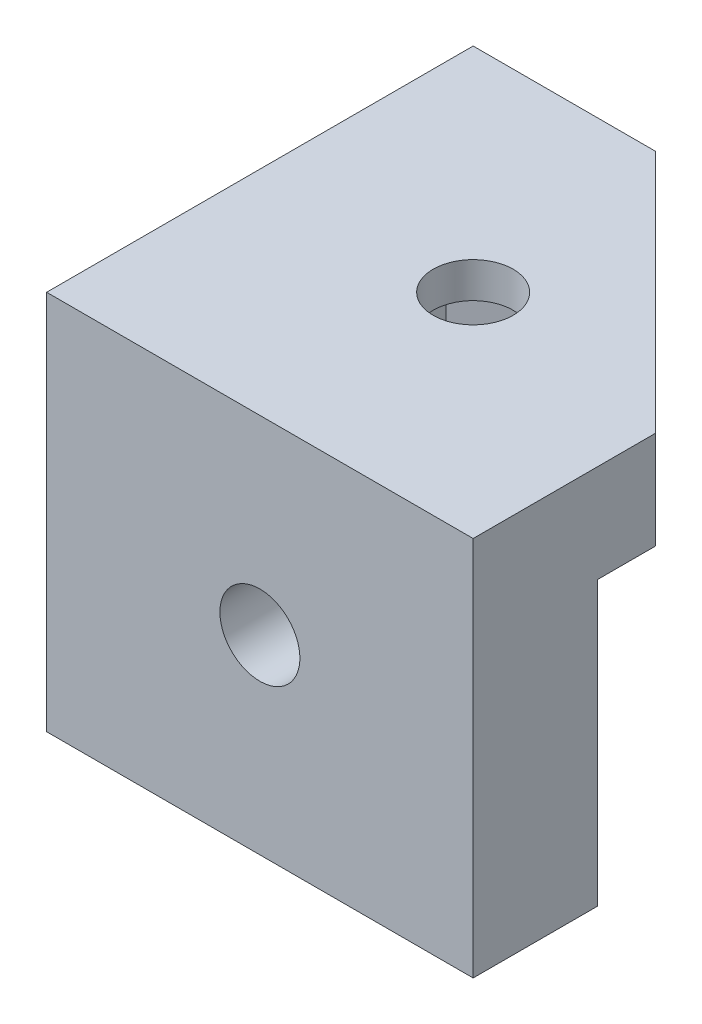
ISO-10303-21;
HEADER;
FILE_DESCRIPTION(('STEP AP214'),'2;1');
FILE_NAME('part.step','',(''),(''),'','','');
FILE_SCHEMA(('AUTOMOTIVE_DESIGN { 1 0 10303 214 1 1 1 1 }'));
ENDSEC;
DATA;
#1=APPLICATION_CONTEXT('core data for automotive mechanical design processes');
#2=APPLICATION_PROTOCOL_DEFINITION('international standard','automotive_design',2000,#1);
#3=PRODUCT_CONTEXT('',#1,'mechanical');
#4=PRODUCT('Part','Part','',(#3));
#5=PRODUCT_RELATED_PRODUCT_CATEGORY('part','',(#4));
#6=PRODUCT_DEFINITION_FORMATION('','',#4);
#7=PRODUCT_DEFINITION_CONTEXT('part definition',#1,'design');
#8=PRODUCT_DEFINITION('design','',#6,#7);
#9=PRODUCT_DEFINITION_SHAPE('','',#8);
#10=(LENGTH_UNIT() NAMED_UNIT(*) SI_UNIT(.MILLI.,.METRE.));
#11=(NAMED_UNIT(*) PLANE_ANGLE_UNIT() SI_UNIT($,.RADIAN.));
#12=(NAMED_UNIT(*) SI_UNIT($,.STERADIAN.) SOLID_ANGLE_UNIT());
#13=UNCERTAINTY_MEASURE_WITH_UNIT(LENGTH_MEASURE(1.E-05),#10,'distance_accuracy_value','');
#14=(GEOMETRIC_REPRESENTATION_CONTEXT(3) GLOBAL_UNCERTAINTY_ASSIGNED_CONTEXT((#13)) GLOBAL_UNIT_ASSIGNED_CONTEXT((#10,
#11,#12)) REPRESENTATION_CONTEXT('',''));
#15=CARTESIAN_POINT('',(0.,0.,0.));
#16=DIRECTION('',(0.,0.,1.));
#17=DIRECTION('',(1.,0.,0.));
#18=AXIS2_PLACEMENT_3D('',#15,#16,#17);
#19=CARTESIAN_POINT('',(19.05,34.000012,-19.05));
#20=DIRECTION('',(0.,-1.,0.));
#21=DIRECTION('',(0.,0.,-1.));
#22=AXIS2_PLACEMENT_3D('',#19,#20,#21);
#23=CYLINDRICAL_SURFACE('',#22,3.571875);
#24=CARTESIAN_POINT('',(19.05,34.,-19.05));
#25=DIRECTION('',(0.,-1.,0.));
#26=DIRECTION('',(0.,0.,-1.));
#27=AXIS2_PLACEMENT_3D('',#24,#25,#26);
#28=CIRCLE('',#27,3.571875);
#29=CARTESIAN_POINT('',(19.05,34.,-22.621875));
#30=VERTEX_POINT('',#29);
#31=EDGE_CURVE('E332',#30,#30,#28,.F.);
#32=ORIENTED_EDGE('',*,*,#31,.T.);
#33=EDGE_LOOP('',(#32));
#34=FACE_BOUND('',#33,.T.);
#35=CARTESIAN_POINT('',(19.05,30.825,-19.05));
#36=DIRECTION('',(0.,-1.,0.));
#37=DIRECTION('',(0.,0.,-1.));
#38=AXIS2_PLACEMENT_3D('',#35,#36,#37);
#39=CIRCLE('',#38,3.571875);
#40=CARTESIAN_POINT('',(19.05,30.825,-22.621875));
#41=VERTEX_POINT('',#40);
#42=EDGE_CURVE('E39',#41,#41,#39,.T.);
#43=ORIENTED_EDGE('',*,*,#42,.T.);
#44=EDGE_LOOP('',(#43));
#45=FACE_BOUND('',#44,.T.);
#46=ADVANCED_FACE('F35',(#34,#45),#23,.F.);
#47=CARTESIAN_POINT('',(0.,25.26875,0.));
#48=DIRECTION('',(0.,-1.,0.));
#49=DIRECTION('',(0.,0.,-1.));
#50=AXIS2_PLACEMENT_3D('',#47,#48,#49);
#51=PLANE('',#50);
#52=DIRECTION('',(0.707106781186548,0.,0.707106781186548));
#53=VECTOR('',#52,1.);
#54=CARTESIAN_POINT('',(16.2767142194378,25.26875,-38.1));
#55=LINE('',#54,#53);
#56=CARTESIAN_POINT('',(16.2767142194378,25.26875,-38.1));
#57=VERTEX_POINT('',#56);
#58=CARTESIAN_POINT('',(38.0999999999858,25.26875,-16.2767142194298));
#59=VERTEX_POINT('',#58);
#60=EDGE_CURVE('E210',#57,#59,#55,.T.);
#61=ORIENTED_EDGE('',*,*,#60,.T.);
#62=DIRECTION('',(0.,0.,1.));
#63=VECTOR('',#62,1.);
#64=CARTESIAN_POINT('',(38.0999999999858,25.26875,291559.995));
#65=LINE('',#64,#63);
#66=CARTESIAN_POINT('',(38.0999999999858,25.26875,-11.1125000000189));
#67=VERTEX_POINT('',#66);
#68=EDGE_CURVE('E223',#59,#67,#65,.T.);
#69=ORIENTED_EDGE('',*,*,#68,.T.);
#70=DIRECTION('',(-1.,0.,0.));
#71=VECTOR('',#70,1.);
#72=CARTESIAN_POINT('',(-399980.95,25.26875,-11.1124999999674));
#73=LINE('',#72,#71);
#74=CARTESIAN_POINT('',(11.1125000000243,25.26875,-11.1125000000189));
#75=VERTEX_POINT('',#74);
#76=EDGE_CURVE('E249',#67,#75,#73,.T.);
#77=ORIENTED_EDGE('',*,*,#76,.T.);
#78=DIRECTION('',(0.,0.,-1.));
#79=VECTOR('',#78,1.);
#80=CARTESIAN_POINT('',(11.1125000000811,25.26875,291559.995));
#81=LINE('',#80,#79);
#82=CARTESIAN_POINT('',(11.1125000000436,25.26875,-38.0999999999858));
#83=VERTEX_POINT('',#82);
#84=EDGE_CURVE('E237',#75,#83,#81,.T.);
#85=ORIENTED_EDGE('',*,*,#84,.T.);
#86=DIRECTION('',(1.,0.,0.));
#87=VECTOR('',#86,1.);
#88=CARTESIAN_POINT('',(-399980.95,25.26875,-38.0999999999858));
#89=LINE('',#88,#87);
#90=EDGE_CURVE('E227',#83,#57,#89,.T.);
#91=ORIENTED_EDGE('',*,*,#90,.T.);
#92=EDGE_LOOP('',(#61,#69,#77,#85,#91));
#93=FACE_BOUND('',#92,.T.);
#94=DIRECTION('',(0.866025403784439,0.,0.5));
#95=VECTOR('',#94,1.);
#96=CARTESIAN_POINT('',(10.1340482210546,25.26875,-17.5526864052195));
#97=LINE('',#96,#95);
#98=CARTESIAN_POINT('',(13.2953125000768,25.26875,-15.7275296227652));
#99=VERTEX_POINT('',#98);
#100=CARTESIAN_POINT('',(19.0500000000497,25.26875,-12.4050592456229));
#101=VERTEX_POINT('',#100);
#102=EDGE_CURVE('E44',#99,#101,#97,.T.);
#103=ORIENTED_EDGE('',*,*,#102,.T.);
#104=DIRECTION('',(0.866025403784439,0.,-0.5));
#105=VECTOR('',#104,1.);
#106=CARTESIAN_POINT('',(-0.609048221065223,25.26875,-1.05490246314441));
#107=LINE('',#106,#105);
#108=CARTESIAN_POINT('',(24.8046875000796,25.26875,-15.7275296228647));
#109=VERTEX_POINT('',#108);
#110=EDGE_CURVE('E12',#101,#109,#107,.T.);
#111=ORIENTED_EDGE('',*,*,#110,.T.);
#112=DIRECTION('',(0.,0.,-1.));
#113=VECTOR('',#112,1.);
#114=CARTESIAN_POINT('',(24.8046875000227,25.26875,0.));
#115=LINE('',#114,#113);
#116=CARTESIAN_POINT('',(24.8046875000227,25.26875,-22.3724703772064));
#117=VERTEX_POINT('',#116);
#118=EDGE_CURVE('E374',#109,#117,#115,.T.);
#119=ORIENTED_EDGE('',*,*,#118,.T.);
#120=DIRECTION('',(-0.866025403784439,0.,-0.5));
#121=VECTOR('',#120,1.);
#122=CARTESIAN_POINT('',(15.8887357210489,25.26875,-27.5200975368912));
#123=LINE('',#122,#121);
#124=CARTESIAN_POINT('',(19.0499999999929,25.26875,-25.6949407544482));
#125=VERTEX_POINT('',#124);
#126=EDGE_CURVE('E377',#117,#125,#123,.T.);
#127=ORIENTED_EDGE('',*,*,#126,.T.);
#128=DIRECTION('',(-0.866025403784439,0.,0.5));
#129=VECTOR('',#128,1.);
#130=CARTESIAN_POINT('',(-6.36373572103821,25.26875,-11.0223135947791));
#131=LINE('',#130,#129);
#132=CARTESIAN_POINT('',(13.2953125000199,25.26875,-22.3724703772064));
#133=VERTEX_POINT('',#132);
#134=EDGE_CURVE('E380',#125,#133,#131,.T.);
#135=ORIENTED_EDGE('',*,*,#134,.T.);
#136=DIRECTION('',(0.,0.,1.));
#137=VECTOR('',#136,1.);
#138=CARTESIAN_POINT('',(13.2953125000199,25.26875,0.));
#139=LINE('',#138,#137);
#140=EDGE_CURVE('E383',#133,#99,#139,.T.);
#141=ORIENTED_EDGE('',*,*,#140,.T.);
#142=EDGE_LOOP('',(#103,#111,#119,#127,#135,#141));
#143=FACE_BOUND('',#142,.T.);
#144=ADVANCED_FACE('F220',(#93,#143),#51,.T.);
#145=CARTESIAN_POINT('',(38.1,34.,-38.1));
#146=DIRECTION('',(-1.,0.,0.));
#147=DIRECTION('',(0.,0.,1.));
#148=AXIS2_PLACEMENT_3D('',#145,#146,#147);
#149=PLANE('',#148);
#150=ORIENTED_EDGE('',*,*,#68,.F.);
#151=DIRECTION('',(0.,1.,0.));
#152=VECTOR('',#151,1.);
#153=CARTESIAN_POINT('',(38.1,-0.001000000000001,-16.2767142194378));
#154=LINE('',#153,#152);
#155=CARTESIAN_POINT('',(38.1,34.,-16.2767142194378));
#156=VERTEX_POINT('',#155);
#157=EDGE_CURVE('E207',#59,#156,#154,.T.);
#158=ORIENTED_EDGE('',*,*,#157,.T.);
#159=DIRECTION('',(0.,0.,-1.));
#160=VECTOR('',#159,1.);
#161=CARTESIAN_POINT('',(38.1,34.,-38.1));
#162=LINE('',#161,#160);
#163=CARTESIAN_POINT('',(38.1,34.,0.));
#164=VERTEX_POINT('',#163);
#165=EDGE_CURVE('E345',#164,#156,#162,.T.);
#166=ORIENTED_EDGE('',*,*,#165,.F.);
#167=DIRECTION('',(0.,-1.,0.));
#168=VECTOR('',#167,1.);
#169=CARTESIAN_POINT('',(38.1,34.,0.));
#170=LINE('',#169,#168);
#171=CARTESIAN_POINT('',(38.1,0.,0.));
#172=VERTEX_POINT('',#171);
#173=EDGE_CURVE('E360',#164,#172,#170,.T.);
#174=ORIENTED_EDGE('',*,*,#173,.T.);
#175=DIRECTION('',(0.,0.,-1.));
#176=VECTOR('',#175,1.);
#177=CARTESIAN_POINT('',(38.1,0.,-38.1));
#178=LINE('',#177,#176);
#179=CARTESIAN_POINT('',(38.0999999999858,0.,-11.1125000000189));
#180=VERTEX_POINT('',#179);
#181=EDGE_CURVE('E355',#172,#180,#178,.T.);
#182=ORIENTED_EDGE('',*,*,#181,.T.);
#183=DIRECTION('',(0.,-1.,0.));
#184=VECTOR('',#183,1.);
#185=CARTESIAN_POINT('',(38.0999999999858,72.1660885144933,-11.1125000000189));
#186=LINE('',#185,#184);
#187=EDGE_CURVE('E232',#67,#180,#186,.T.);
#188=ORIENTED_EDGE('',*,*,#187,.F.);
#189=EDGE_LOOP('',(#150,#158,#166,#174,#182,#188));
#190=FACE_BOUND('',#189,.T.);
#191=ADVANCED_FACE('F230',(#190),#149,.F.);
#192=CARTESIAN_POINT('',(0.,34.,-38.1));
#193=DIRECTION('',(0.,0.,1.));
#194=DIRECTION('',(1.,0.,0.));
#195=AXIS2_PLACEMENT_3D('',#192,#193,#194);
#196=PLANE('',#195);
#197=DIRECTION('',(-1.,0.,0.));
#198=VECTOR('',#197,1.);
#199=CARTESIAN_POINT('',(0.,34.,-38.1));
#200=LINE('',#199,#198);
#201=CARTESIAN_POINT('',(16.2767142194378,34.,-38.1));
#202=VERTEX_POINT('',#201);
#203=CARTESIAN_POINT('',(0.,34.,-38.1));
#204=VERTEX_POINT('',#203);
#205=EDGE_CURVE('E347',#202,#204,#200,.T.);
#206=ORIENTED_EDGE('',*,*,#205,.F.);
#207=DIRECTION('',(0.,1.,0.));
#208=VECTOR('',#207,1.);
#209=CARTESIAN_POINT('',(16.2767142194378,-0.001000000000001,-38.1));
#210=LINE('',#209,#208);
#211=EDGE_CURVE('E51',#57,#202,#210,.T.);
#212=ORIENTED_EDGE('',*,*,#211,.F.);
#213=ORIENTED_EDGE('',*,*,#90,.F.);
#214=DIRECTION('',(0.,-1.,0.));
#215=VECTOR('',#214,1.);
#216=CARTESIAN_POINT('',(11.1125000000436,72.1660885144933,-38.0999999999858));
#217=LINE('',#216,#215);
#218=CARTESIAN_POINT('',(11.1125000000436,0.,-38.0999999999858));
#219=VERTEX_POINT('',#218);
#220=EDGE_CURVE('E246',#83,#219,#217,.T.);
#221=ORIENTED_EDGE('',*,*,#220,.T.);
#222=DIRECTION('',(-1.,0.,0.));
#223=VECTOR('',#222,1.);
#224=CARTESIAN_POINT('',(0.,0.,-38.1));
#225=LINE('',#224,#223);
#226=CARTESIAN_POINT('',(0.,0.,-38.1));
#227=VERTEX_POINT('',#226);
#228=EDGE_CURVE('E343',#219,#227,#225,.T.);
#229=ORIENTED_EDGE('',*,*,#228,.T.);
#230=DIRECTION('',(0.,-1.,0.));
#231=VECTOR('',#230,1.);
#232=CARTESIAN_POINT('',(0.,34.,-38.1));
#233=LINE('',#232,#231);
#234=EDGE_CURVE('E349',#204,#227,#233,.T.);
#235=ORIENTED_EDGE('',*,*,#234,.F.);
#236=EDGE_LOOP('',(#206,#212,#213,#221,#229,#235));
#237=FACE_BOUND('',#236,.T.);
#238=ADVANCED_FACE('F424',(#237),#196,.F.);
#239=CARTESIAN_POINT('',(0.,0.,0.));
#240=DIRECTION('',(0.,-1.,0.));
#241=DIRECTION('',(0.,0.,-1.));
#242=AXIS2_PLACEMENT_3D('',#239,#240,#241);
#243=PLANE('',#242);
#244=DIRECTION('',(0.,0.,1.));
#245=VECTOR('',#244,1.);
#246=CARTESIAN_POINT('',(11.1125000000811,0.,291559.995));
#247=LINE('',#246,#245);
#248=CARTESIAN_POINT('',(11.1125000000436,0.,-11.1125000000189));
#249=VERTEX_POINT('',#248);
#250=EDGE_CURVE('E418',#219,#249,#247,.T.);
#251=ORIENTED_EDGE('',*,*,#250,.T.);
#252=DIRECTION('',(1.,0.,0.));
#253=VECTOR('',#252,1.);
#254=CARTESIAN_POINT('',(-399980.95,0.,-11.1124999999674));
#255=LINE('',#254,#253);
#256=EDGE_CURVE('E243',#249,#180,#255,.T.);
#257=ORIENTED_EDGE('',*,*,#256,.T.);
#258=ORIENTED_EDGE('',*,*,#181,.F.);
#259=DIRECTION('',(1.,0.,0.));
#260=VECTOR('',#259,1.);
#261=CARTESIAN_POINT('',(0.,0.,0.));
#262=LINE('',#261,#260);
#263=CARTESIAN_POINT('',(0.,0.,0.));
#264=VERTEX_POINT('',#263);
#265=EDGE_CURVE('E353',#264,#172,#262,.T.);
#266=ORIENTED_EDGE('',*,*,#265,.F.);
#267=DIRECTION('',(0.,0.,1.));
#268=VECTOR('',#267,1.);
#269=CARTESIAN_POINT('',(0.,0.,0.));
#270=LINE('',#269,#268);
#271=EDGE_CURVE('E350',#227,#264,#270,.T.);
#272=ORIENTED_EDGE('',*,*,#271,.F.);
#273=ORIENTED_EDGE('',*,*,#228,.F.);
#274=EDGE_LOOP('',(#251,#257,#258,#266,#272,#273));
#275=FACE_BOUND('',#274,.T.);
#276=ADVANCED_FACE('F489',(#275),#243,.T.);
#277=CARTESIAN_POINT('',(55.6808607129772,22.7546875000257,-400019.05));
#278=DIRECTION('',(0.,1.,0.));
#279=DIRECTION('',(0.,0.,1.));
#280=AXIS2_PLACEMENT_3D('',#277,#278,#279);
#281=PLANE('',#280);
#282=DIRECTION('',(-1.,0.,0.));
#283=VECTOR('',#282,1.);
#284=CARTESIAN_POINT('',(55.6808607130287,22.7546875000257,-11.1125000000243));
#285=LINE('',#284,#283);
#286=CARTESIAN_POINT('',(22.372470377289,22.7546875000257,-11.1125000000243));
#287=VERTEX_POINT('',#286);
#288=CARTESIAN_POINT('',(15.7275296228363,22.7546875000826,-11.1125000000189));
#289=VERTEX_POINT('',#288);
#290=EDGE_CURVE('E252',#287,#289,#285,.T.);
#291=ORIENTED_EDGE('',*,*,#290,.F.);
#292=DIRECTION('',(0.,0.,1.));
#293=VECTOR('',#292,1.);
#294=CARTESIAN_POINT('',(22.3724703772881,22.7546875000542,-55.6808607131088));
#295=LINE('',#294,#293);
#296=CARTESIAN_POINT('',(22.3724703772881,22.7546875000542,-5.55625));
#297=VERTEX_POINT('',#296);
#298=EDGE_CURVE('E287',#287,#297,#295,.T.);
#299=ORIENTED_EDGE('',*,*,#298,.T.);
#300=DIRECTION('',(-1.,0.,0.));
#301=VECTOR('',#300,1.);
#302=CARTESIAN_POINT('',(-399980.95,22.7546875000257,-5.55625));
#303=LINE('',#302,#301);
#304=CARTESIAN_POINT('',(15.7275296228363,22.7546875000826,-5.55625));
#305=VERTEX_POINT('',#304);
#306=EDGE_CURVE('E268',#297,#305,#303,.T.);
#307=ORIENTED_EDGE('',*,*,#306,.T.);
#308=DIRECTION('',(0.,0.,1.));
#309=VECTOR('',#308,1.);
#310=CARTESIAN_POINT('',(15.7275296228363,22.7546875000826,-55.6808607131088));
#311=LINE('',#310,#309);
#312=EDGE_CURVE('E286',#289,#305,#311,.T.);
#313=ORIENTED_EDGE('',*,*,#312,.F.);
#314=EDGE_LOOP('',(#291,#299,#307,#313));
#315=FACE_BOUND('',#314,.T.);
#316=ADVANCED_FACE('F473',(#315),#281,.F.);
#317=DIRECTION('',(0.,0.,-1.));
#318=VECTOR('',#317,1.);
#319=CARTESIAN_POINT('',(11.1124999999922,22.7546875000257,-400019.05));
#320=LINE('',#319,#318);
#321=CARTESIAN_POINT('',(11.1125000000436,22.7546875000897,-15.7275296228363));
#322=VERTEX_POINT('',#321);
#323=CARTESIAN_POINT('',(11.1125000000436,22.7546875000826,-22.3724703771779));
#324=VERTEX_POINT('',#323);
#325=EDGE_CURVE('E266',#322,#324,#320,.T.);
#326=ORIENTED_EDGE('',*,*,#325,.F.);
#327=DIRECTION('',(-1.,0.,0.));
#328=VECTOR('',#327,1.);
#329=CARTESIAN_POINT('',(55.6808607129772,22.7546875000399,-15.7275296228079));
#330=LINE('',#329,#328);
#331=CARTESIAN_POINT('',(5.55625,22.7546875000399,-15.7275296228079));
#332=VERTEX_POINT('',#331);
#333=EDGE_CURVE('E318',#322,#332,#330,.T.);
#334=ORIENTED_EDGE('',*,*,#333,.T.);
#335=DIRECTION('',(0.,0.,-1.));
#336=VECTOR('',#335,1.);
#337=CARTESIAN_POINT('',(5.55625,22.7546875000257,-400019.05));
#338=LINE('',#337,#336);
#339=CARTESIAN_POINT('',(5.55625,22.7546875000826,-22.3724703771779));
#340=VERTEX_POINT('',#339);
#341=EDGE_CURVE('E299',#332,#340,#338,.T.);
#342=ORIENTED_EDGE('',*,*,#341,.T.);
#343=DIRECTION('',(-1.,0.,0.));
#344=VECTOR('',#343,1.);
#345=CARTESIAN_POINT('',(55.6808607129772,22.7546875000826,-22.3724703771779));
#346=LINE('',#345,#344);
#347=EDGE_CURVE('E317',#324,#340,#346,.T.);
#348=ORIENTED_EDGE('',*,*,#347,.F.);
#349=EDGE_LOOP('',(#326,#334,#342,#348));
#350=FACE_BOUND('',#349,.T.);
#351=ADVANCED_FACE('F528',(#350),#281,.F.);
#352=CARTESIAN_POINT('',(55.6808607129772,-45461.0168993623,26244.3402398116));
#353=DIRECTION('',(0.,0.5,0.866025403784439));
#354=DIRECTION('',(0.,-0.866025403784439,0.5));
#355=AXIS2_PLACEMENT_3D('',#352,#353,#354);
#356=PLANE('',#355);
#357=DIRECTION('',(0.,0.866025403784439,-0.5));
#358=VECTOR('',#357,1.);
#359=CARTESIAN_POINT('',(11.112500000047,-45461.0168993623,26244.3402398116));
#360=LINE('',#359,#358);
#361=CARTESIAN_POINT('',(11.1125000000436,17.0000000001664,-12.4050592455092));
#362=VERTEX_POINT('',#361);
#363=EDGE_CURVE('E264',#362,#322,#360,.T.);
#364=ORIENTED_EDGE('',*,*,#363,.F.);
#365=DIRECTION('',(-1.,0.,0.));
#366=VECTOR('',#365,1.);
#367=CARTESIAN_POINT('',(55.6808607129772,17.0000000001522,-12.4050592456442));
#368=LINE('',#367,#366);
#369=CARTESIAN_POINT('',(5.55625,17.0000000001522,-12.4050592456442));
#370=VERTEX_POINT('',#369);
#371=EDGE_CURVE('E321',#362,#370,#368,.T.);
#372=ORIENTED_EDGE('',*,*,#371,.T.);
#373=DIRECTION('',(0.,0.866025403784439,-0.5));
#374=VECTOR('',#373,1.);
#375=CARTESIAN_POINT('',(5.55625,-45461.0168993623,26244.3402398116));
#376=LINE('',#375,#374);
#377=EDGE_CURVE('E314',#370,#332,#376,.T.);
#378=ORIENTED_EDGE('',*,*,#377,.T.);
#379=ORIENTED_EDGE('',*,*,#333,.F.);
#380=EDGE_LOOP('',(#364,#372,#378,#379));
#381=FACE_BOUND('',#380,.T.);
#382=ADVANCED_FACE('F535',(#381),#356,.F.);
#383=CARTESIAN_POINT('',(55.6808607129772,-391876.933100638,-226272.47282868));
#384=DIRECTION('',(0.,-0.5,0.866025403784439));
#385=DIRECTION('',(0.,-0.866025403784439,-0.5));
#386=AXIS2_PLACEMENT_3D('',#383,#384,#385);
#387=PLANE('',#386);
#388=DIRECTION('',(0.,0.866025403784439,0.5));
#389=VECTOR('',#388,1.);
#390=CARTESIAN_POINT('',(11.1125000000146,-391876.933100638,-226272.47282868));
#391=LINE('',#390,#389);
#392=CARTESIAN_POINT('',(11.1125000000436,11.2453125000229,-15.7275296227226));
#393=VERTEX_POINT('',#392);
#394=EDGE_CURVE('E262',#393,#362,#391,.T.);
#395=ORIENTED_EDGE('',*,*,#394,.F.);
#396=DIRECTION('',(-1.,0.,0.));
#397=VECTOR('',#396,1.);
#398=CARTESIAN_POINT('',(55.6808607129772,11.2453125001934,-15.7275296227226));
#399=LINE('',#398,#397);
#400=CARTESIAN_POINT('',(5.55625,11.2453125001934,-15.7275296227226));
#401=VERTEX_POINT('',#400);
#402=EDGE_CURVE('E323',#393,#401,#399,.T.);
#403=ORIENTED_EDGE('',*,*,#402,.T.);
#404=DIRECTION('',(0.,0.866025403784439,0.5));
#405=VECTOR('',#404,1.);
#406=CARTESIAN_POINT('',(5.55625,-391876.933100638,-226272.47282868));
#407=LINE('',#406,#405);
#408=EDGE_CURVE('E311',#401,#370,#407,.T.);
#409=ORIENTED_EDGE('',*,*,#408,.T.);
#410=ORIENTED_EDGE('',*,*,#371,.F.);
#411=EDGE_LOOP('',(#395,#403,#409,#410));
#412=FACE_BOUND('',#411,.T.);
#413=ADVANCED_FACE('F539',(#412),#387,.F.);
#414=CARTESIAN_POINT('',(55.6808607129772,11.2453125000229,-400019.05));
#415=DIRECTION('',(0.,-1.,0.));
#416=DIRECTION('',(0.,0.,-1.));
#417=AXIS2_PLACEMENT_3D('',#414,#415,#416);
#418=PLANE('',#417);
#419=DIRECTION('',(1.,0.,0.));
#420=VECTOR('',#419,1.);
#421=CARTESIAN_POINT('',(55.6808607130287,11.2453125000229,-11.1125000000243));
#422=LINE('',#421,#420);
#423=CARTESIAN_POINT('',(15.7275296227866,11.2453125000229,-11.1125000000189));
#424=VERTEX_POINT('',#423);
#425=CARTESIAN_POINT('',(22.37247037732,11.2453125000229,-11.1125000000243));
#426=VERTEX_POINT('',#425);
#427=EDGE_CURVE('E235',#424,#426,#422,.T.);
#428=ORIENTED_EDGE('',*,*,#427,.F.);
#429=DIRECTION('',(0.,0.,1.));
#430=VECTOR('',#429,1.);
#431=CARTESIAN_POINT('',(15.7275296227795,11.2453125000229,-55.6808607131088));
#432=LINE('',#431,#430);
#433=CARTESIAN_POINT('',(15.7275296227795,11.2453125000229,-5.55625));
#434=VERTEX_POINT('',#433);
#435=EDGE_CURVE('E294',#424,#434,#432,.T.);
#436=ORIENTED_EDGE('',*,*,#435,.T.);
#437=DIRECTION('',(1.,0.,0.));
#438=VECTOR('',#437,1.);
#439=CARTESIAN_POINT('',(-399980.95,11.2453125000229,-5.55625));
#440=LINE('',#439,#438);
#441=CARTESIAN_POINT('',(22.37247037732,11.2453125001366,-5.55625));
#442=VERTEX_POINT('',#441);
#443=EDGE_CURVE('E277',#434,#442,#440,.T.);
#444=ORIENTED_EDGE('',*,*,#443,.T.);
#445=DIRECTION('',(0.,0.,1.));
#446=VECTOR('',#445,1.);
#447=CARTESIAN_POINT('',(22.37247037732,11.2453125001366,-55.6808607131088));
#448=LINE('',#447,#446);
#449=EDGE_CURVE('E292',#426,#442,#448,.T.);
#450=ORIENTED_EDGE('',*,*,#449,.F.);
#451=EDGE_LOOP('',(#428,#436,#444,#450));
#452=FACE_BOUND('',#451,.T.);
#453=ADVANCED_FACE('F555',(#452),#418,.F.);
#454=DIRECTION('',(0.,0.,1.));
#455=VECTOR('',#454,1.);
#456=CARTESIAN_POINT('',(11.1124999999922,11.2453125000229,-400019.05));
#457=LINE('',#456,#455);
#458=CARTESIAN_POINT('',(11.1125000000436,11.24531250003,-22.3724703771424));
#459=VERTEX_POINT('',#458);
#460=EDGE_CURVE('E260',#459,#393,#457,.T.);
#461=ORIENTED_EDGE('',*,*,#460,.F.);
#462=DIRECTION('',(-1.,0.,0.));
#463=VECTOR('',#462,1.);
#464=CARTESIAN_POINT('',(55.6808607129772,11.2453125000229,-22.3724703771495));
#465=LINE('',#464,#463);
#466=CARTESIAN_POINT('',(5.55625,11.2453125000229,-22.3724703771495));
#467=VERTEX_POINT('',#466);
#468=EDGE_CURVE('E325',#459,#467,#465,.T.);
#469=ORIENTED_EDGE('',*,*,#468,.T.);
#470=DIRECTION('',(0.,0.,1.));
#471=VECTOR('',#470,1.);
#472=CARTESIAN_POINT('',(5.55625,11.2453125000229,-400019.05));
#473=LINE('',#472,#471);
#474=EDGE_CURVE('E308',#467,#401,#473,.T.);
#475=ORIENTED_EDGE('',*,*,#474,.T.);
#476=ORIENTED_EDGE('',*,*,#402,.F.);
#477=EDGE_LOOP('',(#461,#469,#475,#476));
#478=FACE_BOUND('',#477,.T.);
#479=ADVANCED_FACE('F544',(#478),#418,.F.);
#480=CARTESIAN_POINT('',(55.6808607129772,-45466.7715868621,26234.37282868));
#481=DIRECTION('',(0.,-0.5,-0.866025403784439));
#482=DIRECTION('',(0.,0.866025403784439,-0.5));
#483=AXIS2_PLACEMENT_3D('',#480,#481,#482);
#484=PLANE('',#483);
#485=DIRECTION('',(0.,-0.866025403784439,0.5));
#486=VECTOR('',#485,1.);
#487=CARTESIAN_POINT('',(11.112500000047,-45466.7715868621,26234.37282868));
#488=LINE('',#487,#486);
#489=CARTESIAN_POINT('',(11.1125000000436,16.9999999999959,-25.6949407544198));
#490=VERTEX_POINT('',#489);
#491=EDGE_CURVE('E258',#490,#459,#488,.T.);
#492=ORIENTED_EDGE('',*,*,#491,.F.);
#493=DIRECTION('',(-1.,0.,0.));
#494=VECTOR('',#493,1.);
#495=CARTESIAN_POINT('',(55.6808607129772,17.0000000001025,-25.6949407544127));
#496=LINE('',#495,#494);
#497=CARTESIAN_POINT('',(5.55625,17.0000000001025,-25.6949407544127));
#498=VERTEX_POINT('',#497);
#499=EDGE_CURVE('E327',#490,#498,#496,.T.);
#500=ORIENTED_EDGE('',*,*,#499,.T.);
#501=DIRECTION('',(0.,-0.866025403784439,0.5));
#502=VECTOR('',#501,1.);
#503=CARTESIAN_POINT('',(5.55625,-45466.7715868621,26234.37282868));
#504=LINE('',#503,#502);
#505=EDGE_CURVE('E305',#498,#467,#504,.T.);
#506=ORIENTED_EDGE('',*,*,#505,.T.);
#507=ORIENTED_EDGE('',*,*,#468,.F.);
#508=EDGE_LOOP('',(#492,#500,#506,#507));
#509=FACE_BOUND('',#508,.T.);
#510=ADVANCED_FACE('F547',(#509),#484,.F.);
#511=CARTESIAN_POINT('',(55.6808607129772,-391871.178413138,-226282.440239812));
#512=DIRECTION('',(0.,0.5,-0.866025403784439));
#513=DIRECTION('',(0.,0.866025403784439,0.5));
#514=AXIS2_PLACEMENT_3D('',#511,#512,#513);
#515=PLANE('',#514);
#516=DIRECTION('',(0.,-0.866025403784439,-0.5));
#517=VECTOR('',#516,1.);
#518=CARTESIAN_POINT('',(11.1125000000146,-391871.178413138,-226282.440239812));
#519=LINE('',#518,#517);
#520=EDGE_CURVE('E372',#324,#490,#519,.T.);
#521=ORIENTED_EDGE('',*,*,#520,.F.);
#522=ORIENTED_EDGE('',*,*,#347,.T.);
#523=DIRECTION('',(0.,-0.866025403784439,-0.5));
#524=VECTOR('',#523,1.);
#525=CARTESIAN_POINT('',(5.55625,-391871.178413138,-226282.440239812));
#526=LINE('',#525,#524);
#527=EDGE_CURVE('E302',#340,#498,#526,.T.);
#528=ORIENTED_EDGE('',*,*,#527,.T.);
#529=ORIENTED_EDGE('',*,*,#499,.F.);
#530=EDGE_LOOP('',(#521,#522,#528,#529));
#531=FACE_BOUND('',#530,.T.);
#532=ADVANCED_FACE('F526',(#531),#515,.F.);
#533=CARTESIAN_POINT('',(-226234.37282868,-391876.933100638,-55.6808607131088));
#534=DIRECTION('',(0.866025403784439,-0.5,0.));
#535=DIRECTION('',(0.5,0.866025403784439,0.));
#536=AXIS2_PLACEMENT_3D('',#533,#534,#535);
#537=PLANE('',#536);
#538=DIRECTION('',(0.5,0.866025403784439,0.));
#539=VECTOR('',#538,1.);
#540=CARTESIAN_POINT('',(-226234.37282868,-391876.933100638,-11.1124999999898));
#541=LINE('',#540,#539);
#542=CARTESIAN_POINT('',(25.6949407545584,16.9999999999817,-11.1125000000189));
#543=VERTEX_POINT('',#542);
#544=EDGE_CURVE('E256',#426,#543,#541,.T.);
#545=ORIENTED_EDGE('',*,*,#544,.F.);
#546=ORIENTED_EDGE('',*,*,#449,.T.);
#547=DIRECTION('',(0.5,0.866025403784439,0.));
#548=VECTOR('',#547,1.);
#549=CARTESIAN_POINT('',(-226234.37282868,-391876.933100638,-5.55625));
#550=LINE('',#549,#548);
#551=CARTESIAN_POINT('',(25.6949407545086,17.000000000067,-5.55625));
#552=VERTEX_POINT('',#551);
#553=EDGE_CURVE('E280',#442,#552,#550,.T.);
#554=ORIENTED_EDGE('',*,*,#553,.T.);
#555=DIRECTION('',(0.,0.,1.));
#556=VECTOR('',#555,1.);
#557=CARTESIAN_POINT('',(25.6949407545086,17.000000000067,-55.6808607131088));
#558=LINE('',#557,#556);
#559=EDGE_CURVE('E290',#543,#552,#558,.T.);
#560=ORIENTED_EDGE('',*,*,#559,.F.);
#561=EDGE_LOOP('',(#545,#546,#554,#560));
#562=FACE_BOUND('',#561,.T.);
#563=ADVANCED_FACE('F554',(#562),#537,.F.);
#564=CARTESIAN_POINT('',(26272.47282868,-45466.7715868622,-55.6808607131088));
#565=DIRECTION('',(-0.866025403784439,-0.5,0.));
#566=DIRECTION('',(0.5,-0.866025403784439,0.));
#567=AXIS2_PLACEMENT_3D('',#564,#565,#566);
#568=PLANE('',#567);
#569=DIRECTION('',(0.5,-0.866025403784439,0.));
#570=VECTOR('',#569,1.);
#571=CARTESIAN_POINT('',(26272.47282868,-45466.7715868622,-11.1125000000222));
#572=LINE('',#571,#570);
#573=CARTESIAN_POINT('',(12.4050592455376,16.9999999999959,-11.1125000000189));
#574=VERTEX_POINT('',#573);
#575=EDGE_CURVE('E233',#574,#424,#572,.T.);
#576=ORIENTED_EDGE('',*,*,#575,.F.);
#577=DIRECTION('',(0.,0.,1.));
#578=VECTOR('',#577,1.);
#579=CARTESIAN_POINT('',(12.405059245566,17.0000000000172,-55.6808607131088));
#580=LINE('',#579,#578);
#581=CARTESIAN_POINT('',(12.405059245566,17.0000000000172,-5.55625));
#582=VERTEX_POINT('',#581);
#583=EDGE_CURVE('E296',#574,#582,#580,.T.);
#584=ORIENTED_EDGE('',*,*,#583,.T.);
#585=DIRECTION('',(0.5,-0.866025403784439,0.));
#586=VECTOR('',#585,1.);
#587=CARTESIAN_POINT('',(26272.47282868,-45466.7715868622,-5.55625));
#588=LINE('',#587,#586);
#589=EDGE_CURVE('E274',#582,#434,#588,.T.);
#590=ORIENTED_EDGE('',*,*,#589,.T.);
#591=ORIENTED_EDGE('',*,*,#435,.F.);
#592=EDGE_LOOP('',(#576,#584,#590,#591));
#593=FACE_BOUND('',#592,.T.);
#594=ADVANCED_FACE('F571',(#593),#568,.F.);
#595=CARTESIAN_POINT('',(26282.4402398118,-45461.0168993624,-55.6808607131088));
#596=DIRECTION('',(0.866025403784439,0.5,0.));
#597=DIRECTION('',(-0.5,0.866025403784439,0.));
#598=AXIS2_PLACEMENT_3D('',#595,#596,#597);
#599=PLANE('',#598);
#600=DIRECTION('',(-0.5,0.866025403784439,0.));
#601=VECTOR('',#600,1.);
#602=CARTESIAN_POINT('',(26282.4402398118,-45461.0168993624,-11.1125000000222));
#603=LINE('',#602,#601);
#604=EDGE_CURVE('E254',#543,#287,#603,.T.);
#605=ORIENTED_EDGE('',*,*,#604,.F.);
#606=ORIENTED_EDGE('',*,*,#559,.T.);
#607=DIRECTION('',(-0.5,0.866025403784439,0.));
#608=VECTOR('',#607,1.);
#609=CARTESIAN_POINT('',(26282.4402398118,-45461.0168993624,-5.55625));
#610=LINE('',#609,#608);
#611=EDGE_CURVE('E283',#552,#297,#610,.T.);
#612=ORIENTED_EDGE('',*,*,#611,.T.);
#613=ORIENTED_EDGE('',*,*,#298,.F.);
#614=EDGE_LOOP('',(#605,#606,#612,#613));
#615=FACE_BOUND('',#614,.T.);
#616=ADVANCED_FACE('F569',(#615),#599,.F.);
#617=CARTESIAN_POINT('',(-226244.340239812,-391871.178413138,-55.6808607131088));
#618=DIRECTION('',(-0.866025403784439,0.5,0.));
#619=DIRECTION('',(-0.5,-0.866025403784439,0.));
#620=AXIS2_PLACEMENT_3D('',#617,#618,#619);
#621=PLANE('',#620);
#622=DIRECTION('',(-0.5,-0.866025403784439,0.));
#623=VECTOR('',#622,1.);
#624=CARTESIAN_POINT('',(-226244.340239812,-391871.178413138,-11.1124999999898));
#625=LINE('',#624,#623);
#626=EDGE_CURVE('E366',#289,#574,#625,.T.);
#627=ORIENTED_EDGE('',*,*,#626,.F.);
#628=ORIENTED_EDGE('',*,*,#312,.T.);
#629=DIRECTION('',(-0.5,-0.866025403784439,0.));
#630=VECTOR('',#629,1.);
#631=CARTESIAN_POINT('',(-226244.340239812,-391871.178413138,-5.55625));
#632=LINE('',#631,#630);
#633=EDGE_CURVE('E271',#305,#582,#632,.T.);
#634=ORIENTED_EDGE('',*,*,#633,.T.);
#635=ORIENTED_EDGE('',*,*,#583,.F.);
#636=EDGE_LOOP('',(#627,#628,#634,#635));
#637=FACE_BOUND('',#636,.T.);
#638=ADVANCED_FACE('F501',(#637),#621,.F.);
#639=CARTESIAN_POINT('',(0.,34.,0.));
#640=DIRECTION('',(1.,0.,0.));
#641=DIRECTION('',(0.,0.,-1.));
#642=AXIS2_PLACEMENT_3D('',#639,#640,#641);
#643=PLANE('',#642);
#644=CARTESIAN_POINT('',(0.,17.,-19.05));
#645=DIRECTION('',(-1.,0.,0.));
#646=DIRECTION('',(0.,0.,1.));
#647=AXIS2_PLACEMENT_3D('',#644,#645,#646);
#648=CIRCLE('',#647,3.571875);
#649=CARTESIAN_POINT('',(0.,17.,-15.478125));
#650=VERTEX_POINT('',#649);
#651=EDGE_CURVE('E333',#650,#650,#648,.T.);
#652=ORIENTED_EDGE('',*,*,#651,.F.);
#653=EDGE_LOOP('',(#652));
#654=FACE_BOUND('',#653,.T.);
#655=ORIENTED_EDGE('',*,*,#271,.T.);
#656=DIRECTION('',(0.,-1.,0.));
#657=VECTOR('',#656,1.);
#658=CARTESIAN_POINT('',(0.,34.,0.));
#659=LINE('',#658,#657);
#660=CARTESIAN_POINT('',(0.,34.,0.));
#661=VERTEX_POINT('',#660);
#662=EDGE_CURVE('E363',#661,#264,#659,.T.);
#663=ORIENTED_EDGE('',*,*,#662,.F.);
#664=DIRECTION('',(0.,0.,1.));
#665=VECTOR('',#664,1.);
#666=CARTESIAN_POINT('',(0.,34.,0.));
#667=LINE('',#666,#665);
#668=EDGE_CURVE('E339',#204,#661,#667,.T.);
#669=ORIENTED_EDGE('',*,*,#668,.F.);
#670=ORIENTED_EDGE('',*,*,#234,.T.);
#671=EDGE_LOOP('',(#655,#663,#669,#670));
#672=FACE_BOUND('',#671,.T.);
#673=ADVANCED_FACE('F37',(#654,#672),#643,.F.);
#674=CARTESIAN_POINT('',(0.,34.,0.));
#675=DIRECTION('',(0.,0.,-1.));
#676=DIRECTION('',(-1.,0.,0.));
#677=AXIS2_PLACEMENT_3D('',#674,#675,#676);
#678=PLANE('',#677);
#679=CARTESIAN_POINT('',(19.05,17.,0.));
#680=DIRECTION('',(0.,0.,-1.));
#681=DIRECTION('',(-1.,0.,0.));
#682=AXIS2_PLACEMENT_3D('',#679,#680,#681);
#683=CIRCLE('',#682,3.571875);
#684=CARTESIAN_POINT('',(15.478125,17.,0.));
#685=VERTEX_POINT('',#684);
#686=EDGE_CURVE('E336',#685,#685,#683,.F.);
#687=ORIENTED_EDGE('',*,*,#686,.F.);
#688=EDGE_LOOP('',(#687));
#689=FACE_BOUND('',#688,.T.);
#690=ORIENTED_EDGE('',*,*,#265,.T.);
#691=ORIENTED_EDGE('',*,*,#173,.F.);
#692=DIRECTION('',(1.,0.,0.));
#693=VECTOR('',#692,1.);
#694=CARTESIAN_POINT('',(0.,34.,0.));
#695=LINE('',#694,#693);
#696=EDGE_CURVE('E342',#661,#164,#695,.T.);
#697=ORIENTED_EDGE('',*,*,#696,.F.);
#698=ORIENTED_EDGE('',*,*,#662,.T.);
#699=EDGE_LOOP('',(#690,#691,#697,#698));
#700=FACE_BOUND('',#699,.T.);
#701=ADVANCED_FACE('F487',(#689,#700),#678,.F.);
#702=CARTESIAN_POINT('',(0.,34.,0.));
#703=DIRECTION('',(0.,-1.,0.));
#704=DIRECTION('',(0.,0.,-1.));
#705=AXIS2_PLACEMENT_3D('',#702,#703,#704);
#706=PLANE('',#705);
#707=ORIENTED_EDGE('',*,*,#31,.F.);
#708=EDGE_LOOP('',(#707));
#709=FACE_BOUND('',#708,.T.);
#710=ORIENTED_EDGE('',*,*,#165,.T.);
#711=DIRECTION('',(0.707106781186548,0.,0.707106781186548));
#712=VECTOR('',#711,1.);
#713=CARTESIAN_POINT('',(16.2767142194378,34.,-38.1));
#714=LINE('',#713,#712);
#715=EDGE_CURVE('E211',#202,#156,#714,.T.);
#716=ORIENTED_EDGE('',*,*,#715,.F.);
#717=ORIENTED_EDGE('',*,*,#205,.T.);
#718=ORIENTED_EDGE('',*,*,#668,.T.);
#719=ORIENTED_EDGE('',*,*,#696,.T.);
#720=EDGE_LOOP('',(#710,#716,#717,#718,#719));
#721=FACE_BOUND('',#720,.T.);
#722=ADVANCED_FACE('F483',(#709,#721),#706,.F.);
#723=CARTESIAN_POINT('',(19.05,17.,1.2E-05));
#724=DIRECTION('',(0.,0.,-1.));
#725=DIRECTION('',(-1.,0.,0.));
#726=AXIS2_PLACEMENT_3D('',#723,#724,#725);
#727=CYLINDRICAL_SURFACE('',#726,3.571875);
#728=CARTESIAN_POINT('',(19.05,17.,-5.55625));
#729=DIRECTION('',(0.,0.,1.));
#730=DIRECTION('',(1.,0.,0.));
#731=AXIS2_PLACEMENT_3D('',#728,#729,#730);
#732=CIRCLE('',#731,3.571875);
#733=CARTESIAN_POINT('',(22.621875,17.,-5.55625));
#734=VERTEX_POINT('',#733);
#735=EDGE_CURVE('E289',#734,#734,#732,.T.);
#736=ORIENTED_EDGE('',*,*,#735,.F.);
#737=EDGE_LOOP('',(#736));
#738=FACE_BOUND('',#737,.T.);
#739=ORIENTED_EDGE('',*,*,#686,.T.);
#740=EDGE_LOOP('',(#739));
#741=FACE_BOUND('',#740,.T.);
#742=ADVANCED_FACE('F479',(#738,#741),#727,.F.);
#743=CARTESIAN_POINT('',(5.55625,17.,-19.05));
#744=DIRECTION('',(-1.,0.,0.));
#745=DIRECTION('',(0.,0.,1.));
#746=AXIS2_PLACEMENT_3D('',#743,#744,#745);
#747=CYLINDRICAL_SURFACE('',#746,3.571875);
#748=CARTESIAN_POINT('',(5.55625,17.,-19.05));
#749=DIRECTION('',(-1.,0.,0.));
#750=DIRECTION('',(0.,0.,1.));
#751=AXIS2_PLACEMENT_3D('',#748,#749,#750);
#752=CIRCLE('',#751,3.571875);
#753=CARTESIAN_POINT('',(5.55625,17.,-15.478125));
#754=VERTEX_POINT('',#753);
#755=EDGE_CURVE('E320',#754,#754,#752,.T.);
#756=ORIENTED_EDGE('',*,*,#755,.F.);
#757=EDGE_LOOP('',(#756));
#758=FACE_BOUND('',#757,.T.);
#759=ORIENTED_EDGE('',*,*,#651,.T.);
#760=EDGE_LOOP('',(#759));
#761=FACE_BOUND('',#760,.T.);
#762=ADVANCED_FACE('F475',(#758,#761),#747,.F.);
#763=CARTESIAN_POINT('',(5.55625,0.,0.));
#764=DIRECTION('',(-1.,0.,0.));
#765=DIRECTION('',(0.,0.,1.));
#766=AXIS2_PLACEMENT_3D('',#763,#764,#765);
#767=PLANE('',#766);
#768=ORIENTED_EDGE('',*,*,#755,.T.);
#769=EDGE_LOOP('',(#768));
#770=FACE_BOUND('',#769,.T.);
#771=ORIENTED_EDGE('',*,*,#341,.F.);
#772=ORIENTED_EDGE('',*,*,#377,.F.);
#773=ORIENTED_EDGE('',*,*,#408,.F.);
#774=ORIENTED_EDGE('',*,*,#474,.F.);
#775=ORIENTED_EDGE('',*,*,#505,.F.);
#776=ORIENTED_EDGE('',*,*,#527,.F.);
#777=EDGE_LOOP('',(#771,#772,#773,#774,#775,#776));
#778=FACE_BOUND('',#777,.T.);
#779=ADVANCED_FACE('F478',(#770,#778),#767,.F.);
#780=CARTESIAN_POINT('',(0.,0.,-5.55625));
#781=DIRECTION('',(0.,0.,1.));
#782=DIRECTION('',(1.,0.,0.));
#783=AXIS2_PLACEMENT_3D('',#780,#781,#782);
#784=PLANE('',#783);
#785=ORIENTED_EDGE('',*,*,#735,.T.);
#786=EDGE_LOOP('',(#785));
#787=FACE_BOUND('',#786,.T.);
#788=ORIENTED_EDGE('',*,*,#306,.F.);
#789=ORIENTED_EDGE('',*,*,#611,.F.);
#790=ORIENTED_EDGE('',*,*,#553,.F.);
#791=ORIENTED_EDGE('',*,*,#443,.F.);
#792=ORIENTED_EDGE('',*,*,#589,.F.);
#793=ORIENTED_EDGE('',*,*,#633,.F.);
#794=EDGE_LOOP('',(#788,#789,#790,#791,#792,#793));
#795=FACE_BOUND('',#794,.T.);
#796=ADVANCED_FACE('F515',(#787,#795),#784,.F.);
#797=CARTESIAN_POINT('',(11.1125000000811,72.1660885144933,291559.995));
#798=DIRECTION('',(1.,0.,0.));
#799=DIRECTION('',(0.,0.,-1.));
#800=AXIS2_PLACEMENT_3D('',#797,#798,#799);
#801=PLANE('',#800);
#802=DIRECTION('',(0.,-1.,0.));
#803=VECTOR('',#802,1.);
#804=CARTESIAN_POINT('',(11.1125000000243,72.1660885144933,-11.1125000000189));
#805=LINE('',#804,#803);
#806=EDGE_CURVE('E242',#75,#249,#805,.T.);
#807=ORIENTED_EDGE('',*,*,#806,.T.);
#808=ORIENTED_EDGE('',*,*,#250,.F.);
#809=ORIENTED_EDGE('',*,*,#220,.F.);
#810=ORIENTED_EDGE('',*,*,#84,.F.);
#811=EDGE_LOOP('',(#807,#808,#809,#810));
#812=FACE_BOUND('',#811,.T.);
#813=ORIENTED_EDGE('',*,*,#325,.T.);
#814=ORIENTED_EDGE('',*,*,#520,.T.);
#815=ORIENTED_EDGE('',*,*,#491,.T.);
#816=ORIENTED_EDGE('',*,*,#460,.T.);
#817=ORIENTED_EDGE('',*,*,#394,.T.);
#818=ORIENTED_EDGE('',*,*,#363,.T.);
#819=EDGE_LOOP('',(#813,#814,#815,#816,#817,#818));
#820=FACE_BOUND('',#819,.T.);
#821=ADVANCED_FACE('F512',(#812,#820),#801,.T.);
#822=CARTESIAN_POINT('',(-399980.95,72.1660885144933,-11.1124999999674));
#823=DIRECTION('',(0.,0.,-1.));
#824=DIRECTION('',(-1.,0.,0.));
#825=AXIS2_PLACEMENT_3D('',#822,#823,#824);
#826=PLANE('',#825);
#827=ORIENTED_EDGE('',*,*,#187,.T.);
#828=ORIENTED_EDGE('',*,*,#256,.F.);
#829=ORIENTED_EDGE('',*,*,#806,.F.);
#830=ORIENTED_EDGE('',*,*,#76,.F.);
#831=EDGE_LOOP('',(#827,#828,#829,#830));
#832=FACE_BOUND('',#831,.T.);
#833=ORIENTED_EDGE('',*,*,#544,.T.);
#834=ORIENTED_EDGE('',*,*,#604,.T.);
#835=ORIENTED_EDGE('',*,*,#290,.T.);
#836=ORIENTED_EDGE('',*,*,#626,.T.);
#837=ORIENTED_EDGE('',*,*,#575,.T.);
#838=ORIENTED_EDGE('',*,*,#427,.T.);
#839=EDGE_LOOP('',(#833,#834,#835,#836,#837,#838));
#840=FACE_BOUND('',#839,.T.);
#841=ADVANCED_FACE('F510',(#832,#840),#826,.T.);
#842=CARTESIAN_POINT('',(-426235.502746853,51.5808607130202,246085.775712454));
#843=DIRECTION('',(-0.5,0.,-0.866025403784439));
#844=DIRECTION('',(-0.866025403784439,0.,0.5));
#845=AXIS2_PLACEMENT_3D('',#842,#843,#844);
#846=PLANE('',#845);
#847=DIRECTION('',(0.,-1.,0.));
#848=VECTOR('',#847,1.);
#849=CARTESIAN_POINT('',(19.0500000000497,51.5808607130202,-12.4050592456229));
#850=LINE('',#849,#848);
#851=CARTESIAN_POINT('',(19.0500000000497,30.825,-12.4050592456229));
#852=VERTEX_POINT('',#851);
#853=EDGE_CURVE('E395',#852,#101,#850,.T.);
#854=ORIENTED_EDGE('',*,*,#853,.F.);
#855=DIRECTION('',(-0.866025403784439,0.,0.5));
#856=VECTOR('',#855,1.);
#857=CARTESIAN_POINT('',(-426235.502746853,30.825,246085.775712454));
#858=LINE('',#857,#856);
#859=CARTESIAN_POINT('',(24.8046875000796,30.825,-15.7275296228647));
#860=VERTEX_POINT('',#859);
#861=EDGE_CURVE('E412',#860,#852,#858,.T.);
#862=ORIENTED_EDGE('',*,*,#861,.F.);
#863=DIRECTION('',(0.,-1.,0.));
#864=VECTOR('',#863,1.);
#865=CARTESIAN_POINT('',(24.8046875000796,51.5808607130202,-15.7275296228647));
#866=LINE('',#865,#864);
#867=EDGE_CURVE('E216',#860,#109,#866,.T.);
#868=ORIENTED_EDGE('',*,*,#867,.T.);
#869=ORIENTED_EDGE('',*,*,#110,.F.);
#870=EDGE_LOOP('',(#854,#862,#868,#869));
#871=FACE_BOUND('',#870,.T.);
#872=ADVANCED_FACE('F443',(#871),#846,.T.);
#873=CARTESIAN_POINT('',(-173726.397253147,51.5808607130202,-100324.385801322));
#874=DIRECTION('',(0.5,0.,-0.866025403784439));
#875=DIRECTION('',(-0.866025403784439,0.,-0.5));
#876=AXIS2_PLACEMENT_3D('',#873,#874,#875);
#877=PLANE('',#876);
#878=DIRECTION('',(0.,-1.,0.));
#879=VECTOR('',#878,1.);
#880=CARTESIAN_POINT('',(13.2953125000768,51.5808607130202,-15.7275296227652));
#881=LINE('',#880,#879);
#882=CARTESIAN_POINT('',(13.2953125000768,30.825,-15.7275296227652));
#883=VERTEX_POINT('',#882);
#884=EDGE_CURVE('E392',#883,#99,#881,.T.);
#885=ORIENTED_EDGE('',*,*,#884,.F.);
#886=DIRECTION('',(-0.866025403784439,0.,-0.5));
#887=VECTOR('',#886,1.);
#888=CARTESIAN_POINT('',(-173726.397253147,30.825,-100324.385801322));
#889=LINE('',#888,#887);
#890=EDGE_CURVE('E415',#852,#883,#889,.T.);
#891=ORIENTED_EDGE('',*,*,#890,.F.);
#892=ORIENTED_EDGE('',*,*,#853,.T.);
#893=ORIENTED_EDGE('',*,*,#102,.F.);
#894=EDGE_LOOP('',(#885,#891,#892,#893));
#895=FACE_BOUND('',#894,.T.);
#896=ADVANCED_FACE('F391',(#895),#877,.T.);
#897=CARTESIAN_POINT('',(13.2953125000199,51.5808607130202,291559.995));
#898=DIRECTION('',(1.,0.,0.));
#899=DIRECTION('',(0.,0.,-1.));
#900=AXIS2_PLACEMENT_3D('',#897,#898,#899);
#901=PLANE('',#900);
#902=DIRECTION('',(0.,-1.,0.));
#903=VECTOR('',#902,1.);
#904=CARTESIAN_POINT('',(13.2953125000199,51.5808607130202,-22.3724703772064));
#905=LINE('',#904,#903);
#906=CARTESIAN_POINT('',(13.2953125000199,30.825,-22.3724703772064));
#907=VERTEX_POINT('',#906);
#908=EDGE_CURVE('E402',#907,#133,#905,.T.);
#909=ORIENTED_EDGE('',*,*,#908,.F.);
#910=DIRECTION('',(0.,0.,-1.));
#911=VECTOR('',#910,1.);
#912=CARTESIAN_POINT('',(13.2953125000199,30.825,291559.995));
#913=LINE('',#912,#911);
#914=EDGE_CURVE('E401',#883,#907,#913,.T.);
#915=ORIENTED_EDGE('',*,*,#914,.F.);
#916=ORIENTED_EDGE('',*,*,#884,.T.);
#917=ORIENTED_EDGE('',*,*,#140,.F.);
#918=EDGE_LOOP('',(#909,#915,#916,#917));
#919=FACE_BOUND('',#918,.T.);
#920=ADVANCED_FACE('F398',(#919),#901,.T.);
#921=CARTESIAN_POINT('',(-426241.257434353,51.5808607130202,246075.808301322));
#922=DIRECTION('',(0.5,0.,0.866025403784439));
#923=DIRECTION('',(0.866025403784439,0.,-0.5));
#924=AXIS2_PLACEMENT_3D('',#921,#922,#923);
#925=PLANE('',#924);
#926=DIRECTION('',(0.,-1.,0.));
#927=VECTOR('',#926,1.);
#928=CARTESIAN_POINT('',(19.0499999999929,51.5808607130202,-25.6949407544482));
#929=LINE('',#928,#927);
#930=CARTESIAN_POINT('',(19.0499999999929,30.825,-25.6949407544482));
#931=VERTEX_POINT('',#930);
#932=EDGE_CURVE('E404',#931,#125,#929,.T.);
#933=ORIENTED_EDGE('',*,*,#932,.F.);
#934=DIRECTION('',(0.866025403784439,0.,-0.5));
#935=VECTOR('',#934,1.);
#936=CARTESIAN_POINT('',(-426241.257434353,30.825,246075.808301322));
#937=LINE('',#936,#935);
#938=EDGE_CURVE('E432',#907,#931,#937,.T.);
#939=ORIENTED_EDGE('',*,*,#938,.F.);
#940=ORIENTED_EDGE('',*,*,#908,.T.);
#941=ORIENTED_EDGE('',*,*,#134,.F.);
#942=EDGE_LOOP('',(#933,#939,#940,#941));
#943=FACE_BOUND('',#942,.T.);
#944=ADVANCED_FACE('F449',(#943),#925,.T.);
#945=CARTESIAN_POINT('',(-173720.642565647,51.5808607130202,-100334.353212454));
#946=DIRECTION('',(-0.5,0.,0.866025403784439));
#947=DIRECTION('',(0.866025403784439,0.,0.5));
#948=AXIS2_PLACEMENT_3D('',#945,#946,#947);
#949=PLANE('',#948);
#950=DIRECTION('',(0.,-1.,0.));
#951=VECTOR('',#950,1.);
#952=CARTESIAN_POINT('',(24.8046875000227,51.5808607130202,-22.3724703772064));
#953=LINE('',#952,#951);
#954=CARTESIAN_POINT('',(24.8046875000227,30.825,-22.3724703771921));
#955=VERTEX_POINT('',#954);
#956=EDGE_CURVE('E59',#955,#117,#953,.T.);
#957=ORIENTED_EDGE('',*,*,#956,.F.);
#958=DIRECTION('',(0.866025403784439,0.,0.5));
#959=VECTOR('',#958,1.);
#960=CARTESIAN_POINT('',(-173720.642565647,30.825,-100334.353212454));
#961=LINE('',#960,#959);
#962=EDGE_CURVE('E435',#931,#955,#961,.T.);
#963=ORIENTED_EDGE('',*,*,#962,.F.);
#964=ORIENTED_EDGE('',*,*,#932,.T.);
#965=ORIENTED_EDGE('',*,*,#126,.F.);
#966=EDGE_LOOP('',(#957,#963,#964,#965));
#967=FACE_BOUND('',#966,.T.);
#968=ADVANCED_FACE('F446',(#967),#949,.T.);
#969=CARTESIAN_POINT('',(24.8046875000227,51.5808607130202,291559.995));
#970=DIRECTION('',(-1.,0.,0.));
#971=DIRECTION('',(0.,0.,1.));
#972=AXIS2_PLACEMENT_3D('',#969,#970,#971);
#973=PLANE('',#972);
#974=ORIENTED_EDGE('',*,*,#867,.F.);
#975=DIRECTION('',(0.,0.,1.));
#976=VECTOR('',#975,1.);
#977=CARTESIAN_POINT('',(24.8046875000227,30.825,291559.995));
#978=LINE('',#977,#976);
#979=EDGE_CURVE('E438',#955,#860,#978,.T.);
#980=ORIENTED_EDGE('',*,*,#979,.F.);
#981=ORIENTED_EDGE('',*,*,#956,.T.);
#982=ORIENTED_EDGE('',*,*,#118,.F.);
#983=EDGE_LOOP('',(#974,#980,#981,#982));
#984=FACE_BOUND('',#983,.T.);
#985=ADVANCED_FACE('F444',(#984),#973,.T.);
#986=CARTESIAN_POINT('',(0.,30.825,0.));
#987=DIRECTION('',(0.,-1.,0.));
#988=DIRECTION('',(0.,0.,-1.));
#989=AXIS2_PLACEMENT_3D('',#986,#987,#988);
#990=PLANE('',#989);
#991=ORIENTED_EDGE('',*,*,#42,.F.);
#992=EDGE_LOOP('',(#991));
#993=FACE_BOUND('',#992,.T.);
#994=ORIENTED_EDGE('',*,*,#962,.T.);
#995=ORIENTED_EDGE('',*,*,#979,.T.);
#996=ORIENTED_EDGE('',*,*,#861,.T.);
#997=ORIENTED_EDGE('',*,*,#890,.T.);
#998=ORIENTED_EDGE('',*,*,#914,.T.);
#999=ORIENTED_EDGE('',*,*,#938,.T.);
#1000=EDGE_LOOP('',(#994,#995,#996,#997,#998,#999));
#1001=FACE_BOUND('',#1000,.T.);
#1002=ADVANCED_FACE('F451',(#993,#1001),#990,.T.);
#1003=CARTESIAN_POINT('',(16.2767142194378,-0.001000000000001,-38.1));
#1004=DIRECTION('',(-0.707106781186547,0.,0.707106781186547));
#1005=DIRECTION('',(0.707106781186548,0.,0.707106781186548));
#1006=AXIS2_PLACEMENT_3D('',#1003,#1004,#1005);
#1007=PLANE('',#1006);
#1008=ORIENTED_EDGE('',*,*,#211,.T.);
#1009=ORIENTED_EDGE('',*,*,#715,.T.);
#1010=ORIENTED_EDGE('',*,*,#157,.F.);
#1011=ORIENTED_EDGE('',*,*,#60,.F.);
#1012=EDGE_LOOP('',(#1008,#1009,#1010,#1011));
#1013=FACE_BOUND('',#1012,.T.);
#1014=ADVANCED_FACE('F209',(#1013),#1007,.F.);
#1015=CLOSED_SHELL('',(#46,#144,#191,#238,#276,#316,#351,#382,#413,#453,#479,#510,#532,#563,
#594,#616,#638,#673,#701,#722,#742,#762,#779,#796,#821,#841,#872,#896,#920,#944,#968,#985,#1002,#1014));
#1016=MANIFOLD_SOLID_BREP('B2',#1015);
#1017=ADVANCED_BREP_SHAPE_REPRESENTATION('',(#18,#1016),#14);
#1018=SHAPE_DEFINITION_REPRESENTATION(#9,#1017);
ENDSEC;
END-ISO-10303-21;
